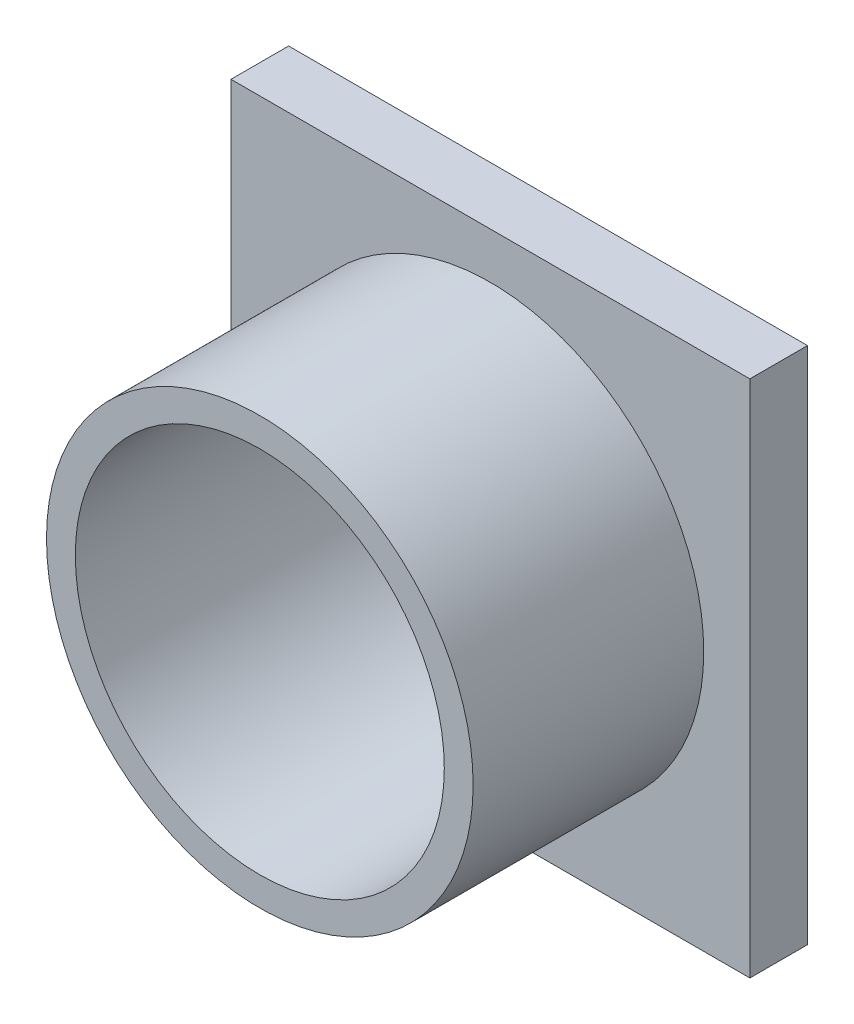
ISO-10303-21;
HEADER;
FILE_DESCRIPTION(('STEP AP214'),'2;1');
FILE_NAME('part.step','',(''),(''),'','','');
FILE_SCHEMA(('AUTOMOTIVE_DESIGN { 1 0 10303 214 1 1 1 1 }'));
ENDSEC;
DATA;
#1=APPLICATION_CONTEXT('core data for automotive mechanical design processes');
#2=APPLICATION_PROTOCOL_DEFINITION('international standard','automotive_design',2000,#1);
#3=PRODUCT_CONTEXT('',#1,'mechanical');
#4=PRODUCT('Part','Part','',(#3));
#5=PRODUCT_RELATED_PRODUCT_CATEGORY('part','',(#4));
#6=PRODUCT_DEFINITION_FORMATION('','',#4);
#7=PRODUCT_DEFINITION_CONTEXT('part definition',#1,'design');
#8=PRODUCT_DEFINITION('design','',#6,#7);
#9=PRODUCT_DEFINITION_SHAPE('','',#8);
#10=(LENGTH_UNIT() NAMED_UNIT(*) SI_UNIT(.MILLI.,.METRE.));
#11=(NAMED_UNIT(*) PLANE_ANGLE_UNIT() SI_UNIT($,.RADIAN.));
#12=(NAMED_UNIT(*) SI_UNIT($,.STERADIAN.) SOLID_ANGLE_UNIT());
#13=UNCERTAINTY_MEASURE_WITH_UNIT(LENGTH_MEASURE(1.E-05),#10,'distance_accuracy_value','');
#14=(GEOMETRIC_REPRESENTATION_CONTEXT(3) GLOBAL_UNCERTAINTY_ASSIGNED_CONTEXT((#13)) GLOBAL_UNIT_ASSIGNED_CONTEXT((#10,
#11,#12)) REPRESENTATION_CONTEXT('',''));
#15=CARTESIAN_POINT('',(0.,0.,0.));
#16=DIRECTION('',(0.,0.,1.));
#17=DIRECTION('',(1.,0.,0.));
#18=AXIS2_PLACEMENT_3D('',#15,#16,#17);
#19=CARTESIAN_POINT('',(0.,0.,0.));
#20=DIRECTION('',(0.,0.,1.));
#21=DIRECTION('',(1.,0.,0.));
#22=AXIS2_PLACEMENT_3D('',#19,#20,#21);
#23=PLANE('',#22);
#24=DIRECTION('',(-1.,0.,0.));
#25=VECTOR('',#24,1.);
#26=CARTESIAN_POINT('',(19.,-19.,0.));
#27=LINE('',#26,#25);
#28=CARTESIAN_POINT('',(19.,-19.,0.));
#29=VERTEX_POINT('',#28);
#30=CARTESIAN_POINT('',(14.,-19.,0.));
#31=VERTEX_POINT('',#30);
#32=EDGE_CURVE('E228',#29,#31,#27,.T.);
#33=ORIENTED_EDGE('',*,*,#32,.F.);
#34=DIRECTION('',(0.,-1.,0.));
#35=VECTOR('',#34,1.);
#36=CARTESIAN_POINT('',(19.,-19.,0.));
#37=LINE('',#36,#35);
#38=CARTESIAN_POINT('',(19.,-15.,0.));
#39=VERTEX_POINT('',#38);
#40=EDGE_CURVE('E218',#39,#29,#37,.T.);
#41=ORIENTED_EDGE('',*,*,#40,.F.);
#42=DIRECTION('',(1.,0.,0.));
#43=VECTOR('',#42,1.);
#44=CARTESIAN_POINT('',(19.,-15.,0.));
#45=LINE('',#44,#43);
#46=CARTESIAN_POINT('',(14.,-15.,0.));
#47=VERTEX_POINT('',#46);
#48=EDGE_CURVE('E221',#47,#39,#45,.T.);
#49=ORIENTED_EDGE('',*,*,#48,.F.);
#50=DIRECTION('',(0.,1.,0.));
#51=VECTOR('',#50,1.);
#52=CARTESIAN_POINT('',(14.,-19.,0.));
#53=LINE('',#52,#51);
#54=EDGE_CURVE('E225',#31,#47,#53,.T.);
#55=ORIENTED_EDGE('',*,*,#54,.F.);
#56=EDGE_LOOP('',(#33,#41,#49,#55));
#57=FACE_BOUND('',#56,.T.);
#58=DIRECTION('',(0.,1.,0.));
#59=VECTOR('',#58,1.);
#60=CARTESIAN_POINT('',(14.,19.,0.));
#61=LINE('',#60,#59);
#62=CARTESIAN_POINT('',(14.,15.,0.));
#63=VERTEX_POINT('',#62);
#64=CARTESIAN_POINT('',(14.,19.,0.));
#65=VERTEX_POINT('',#64);
#66=EDGE_CURVE('E264',#63,#65,#61,.T.);
#67=ORIENTED_EDGE('',*,*,#66,.F.);
#68=DIRECTION('',(-1.,0.,0.));
#69=VECTOR('',#68,1.);
#70=CARTESIAN_POINT('',(19.,15.,0.));
#71=LINE('',#70,#69);
#72=CARTESIAN_POINT('',(19.,15.,0.));
#73=VERTEX_POINT('',#72);
#74=EDGE_CURVE('E276',#73,#63,#71,.T.);
#75=ORIENTED_EDGE('',*,*,#74,.F.);
#76=DIRECTION('',(0.,-1.,0.));
#77=VECTOR('',#76,1.);
#78=CARTESIAN_POINT('',(19.,19.,0.));
#79=LINE('',#78,#77);
#80=CARTESIAN_POINT('',(19.,19.,0.));
#81=VERTEX_POINT('',#80);
#82=EDGE_CURVE('E288',#81,#73,#79,.T.);
#83=ORIENTED_EDGE('',*,*,#82,.F.);
#84=DIRECTION('',(1.,0.,0.));
#85=VECTOR('',#84,1.);
#86=CARTESIAN_POINT('',(19.,19.,0.));
#87=LINE('',#86,#85);
#88=EDGE_CURVE('E285',#65,#81,#87,.T.);
#89=ORIENTED_EDGE('',*,*,#88,.F.);
#90=EDGE_LOOP('',(#67,#75,#83,#89));
#91=FACE_BOUND('',#90,.T.);
#92=DIRECTION('',(0.,1.,0.));
#93=VECTOR('',#92,1.);
#94=CARTESIAN_POINT('',(22.5,22.5,0.));
#95=LINE('',#94,#93);
#96=CARTESIAN_POINT('',(22.5,-22.5,0.));
#97=VERTEX_POINT('',#96);
#98=CARTESIAN_POINT('',(22.5,22.5,0.));
#99=VERTEX_POINT('',#98);
#100=EDGE_CURVE('E316',#97,#99,#95,.T.);
#101=ORIENTED_EDGE('',*,*,#100,.F.);
#102=DIRECTION('',(1.,0.,0.));
#103=VECTOR('',#102,1.);
#104=CARTESIAN_POINT('',(-22.5,-22.5,0.));
#105=LINE('',#104,#103);
#106=CARTESIAN_POINT('',(-22.5,-22.5,0.));
#107=VERTEX_POINT('',#106);
#108=EDGE_CURVE('E321',#107,#97,#105,.T.);
#109=ORIENTED_EDGE('',*,*,#108,.F.);
#110=DIRECTION('',(0.,-1.,0.));
#111=VECTOR('',#110,1.);
#112=CARTESIAN_POINT('',(-22.5,22.5,0.));
#113=LINE('',#112,#111);
#114=CARTESIAN_POINT('',(-22.5,22.5,0.));
#115=VERTEX_POINT('',#114);
#116=EDGE_CURVE('E332',#115,#107,#113,.T.);
#117=ORIENTED_EDGE('',*,*,#116,.F.);
#118=DIRECTION('',(-1.,0.,0.));
#119=VECTOR('',#118,1.);
#120=CARTESIAN_POINT('',(-22.5,22.5,0.));
#121=LINE('',#120,#119);
#122=EDGE_CURVE('E330',#99,#115,#121,.T.);
#123=ORIENTED_EDGE('',*,*,#122,.F.);
#124=EDGE_LOOP('',(#101,#109,#117,#123));
#125=FACE_BOUND('',#124,.T.);
#126=CARTESIAN_POINT('',(0.,0.,0.));
#127=DIRECTION('',(0.,0.,1.));
#128=DIRECTION('',(1.,0.,0.));
#129=AXIS2_PLACEMENT_3D('',#126,#127,#128);
#130=CIRCLE('',#129,16.);
#131=CARTESIAN_POINT('',(16.,0.,0.));
#132=VERTEX_POINT('',#131);
#133=EDGE_CURVE('E311',#132,#132,#130,.T.);
#134=ORIENTED_EDGE('',*,*,#133,.T.);
#135=EDGE_LOOP('',(#134));
#136=FACE_BOUND('',#135,.T.);
#137=DIRECTION('',(1.,0.,0.));
#138=VECTOR('',#137,1.);
#139=CARTESIAN_POINT('',(-19.,19.,0.));
#140=LINE('',#139,#138);
#141=CARTESIAN_POINT('',(-19.,19.,0.));
#142=VERTEX_POINT('',#141);
#143=CARTESIAN_POINT('',(-14.,19.,0.));
#144=VERTEX_POINT('',#143);
#145=EDGE_CURVE('E261',#142,#144,#140,.T.);
#146=ORIENTED_EDGE('',*,*,#145,.F.);
#147=DIRECTION('',(0.,1.,0.));
#148=VECTOR('',#147,1.);
#149=CARTESIAN_POINT('',(-19.,19.,0.));
#150=LINE('',#149,#148);
#151=CARTESIAN_POINT('',(-19.,15.,0.));
#152=VERTEX_POINT('',#151);
#153=EDGE_CURVE('E251',#152,#142,#150,.T.);
#154=ORIENTED_EDGE('',*,*,#153,.F.);
#155=DIRECTION('',(-1.,0.,0.));
#156=VECTOR('',#155,1.);
#157=CARTESIAN_POINT('',(-19.,15.,0.));
#158=LINE('',#157,#156);
#159=CARTESIAN_POINT('',(-14.,15.,0.));
#160=VERTEX_POINT('',#159);
#161=EDGE_CURVE('E254',#160,#152,#158,.T.);
#162=ORIENTED_EDGE('',*,*,#161,.F.);
#163=DIRECTION('',(0.,-1.,0.));
#164=VECTOR('',#163,1.);
#165=CARTESIAN_POINT('',(-14.,19.,0.));
#166=LINE('',#165,#164);
#167=EDGE_CURVE('E258',#144,#160,#166,.T.);
#168=ORIENTED_EDGE('',*,*,#167,.F.);
#169=EDGE_LOOP('',(#146,#154,#162,#168));
#170=FACE_BOUND('',#169,.T.);
#171=DIRECTION('',(0.,1.,0.));
#172=VECTOR('',#171,1.);
#173=CARTESIAN_POINT('',(-19.,-19.,0.));
#174=LINE('',#173,#172);
#175=CARTESIAN_POINT('',(-19.,-19.,0.));
#176=VERTEX_POINT('',#175);
#177=CARTESIAN_POINT('',(-19.,-15.,0.));
#178=VERTEX_POINT('',#177);
#179=EDGE_CURVE('E171',#176,#178,#174,.T.);
#180=ORIENTED_EDGE('',*,*,#179,.F.);
#181=DIRECTION('',(-1.,0.,0.));
#182=VECTOR('',#181,1.);
#183=CARTESIAN_POINT('',(-19.,-19.,0.));
#184=LINE('',#183,#182);
#185=CARTESIAN_POINT('',(-14.,-19.,0.));
#186=VERTEX_POINT('',#185);
#187=EDGE_CURVE('E173',#186,#176,#184,.T.);
#188=ORIENTED_EDGE('',*,*,#187,.F.);
#189=DIRECTION('',(0.,-1.,0.));
#190=VECTOR('',#189,1.);
#191=CARTESIAN_POINT('',(-14.,-19.,0.));
#192=LINE('',#191,#190);
#193=CARTESIAN_POINT('',(-14.,-15.,0.));
#194=VERTEX_POINT('',#193);
#195=EDGE_CURVE('E58',#194,#186,#192,.T.);
#196=ORIENTED_EDGE('',*,*,#195,.F.);
#197=DIRECTION('',(1.,0.,0.));
#198=VECTOR('',#197,1.);
#199=CARTESIAN_POINT('',(-19.,-15.,0.));
#200=LINE('',#199,#198);
#201=EDGE_CURVE('E53',#178,#194,#200,.T.);
#202=ORIENTED_EDGE('',*,*,#201,.F.);
#203=EDGE_LOOP('',(#180,#188,#196,#202));
#204=FACE_BOUND('',#203,.T.);
#205=ADVANCED_FACE('F38',(#57,#91,#125,#136,#170,#204),#23,.F.);
#206=CARTESIAN_POINT('',(0.,0.,5.));
#207=DIRECTION('',(0.,0.,1.));
#208=DIRECTION('',(1.,0.,0.));
#209=AXIS2_PLACEMENT_3D('',#206,#207,#208);
#210=PLANE('',#209);
#211=DIRECTION('',(0.,1.,0.));
#212=VECTOR('',#211,1.);
#213=CARTESIAN_POINT('',(22.5,22.5,5.));
#214=LINE('',#213,#212);
#215=CARTESIAN_POINT('',(22.5,-22.5,5.));
#216=VERTEX_POINT('',#215);
#217=CARTESIAN_POINT('',(22.5,22.5,5.));
#218=VERTEX_POINT('',#217);
#219=EDGE_CURVE('E317',#216,#218,#214,.T.);
#220=ORIENTED_EDGE('',*,*,#219,.T.);
#221=DIRECTION('',(-1.,0.,0.));
#222=VECTOR('',#221,1.);
#223=CARTESIAN_POINT('',(-22.5,22.5,5.));
#224=LINE('',#223,#222);
#225=CARTESIAN_POINT('',(-22.5,22.5,5.));
#226=VERTEX_POINT('',#225);
#227=EDGE_CURVE('E320',#218,#226,#224,.T.);
#228=ORIENTED_EDGE('',*,*,#227,.T.);
#229=DIRECTION('',(0.,-1.,0.));
#230=VECTOR('',#229,1.);
#231=CARTESIAN_POINT('',(-22.5,22.5,5.));
#232=LINE('',#231,#230);
#233=CARTESIAN_POINT('',(-22.5,-22.5,5.));
#234=VERTEX_POINT('',#233);
#235=EDGE_CURVE('E323',#226,#234,#232,.T.);
#236=ORIENTED_EDGE('',*,*,#235,.T.);
#237=DIRECTION('',(1.,0.,0.));
#238=VECTOR('',#237,1.);
#239=CARTESIAN_POINT('',(-22.5,-22.5,5.));
#240=LINE('',#239,#238);
#241=EDGE_CURVE('E325',#234,#216,#240,.T.);
#242=ORIENTED_EDGE('',*,*,#241,.T.);
#243=EDGE_LOOP('',(#220,#228,#236,#242));
#244=FACE_BOUND('',#243,.T.);
#245=CARTESIAN_POINT('',(0.,0.,5.));
#246=DIRECTION('',(0.,0.,1.));
#247=DIRECTION('',(1.,0.,0.));
#248=AXIS2_PLACEMENT_3D('',#245,#246,#247);
#249=CIRCLE('',#248,18.5);
#250=CARTESIAN_POINT('',(18.5,0.,5.));
#251=VERTEX_POINT('',#250);
#252=EDGE_CURVE('E307',#251,#251,#249,.T.);
#253=ORIENTED_EDGE('',*,*,#252,.F.);
#254=EDGE_LOOP('',(#253));
#255=FACE_BOUND('',#254,.T.);
#256=ADVANCED_FACE('F359',(#244,#255),#210,.T.);
#257=CARTESIAN_POINT('',(22.5,22.5,5.));
#258=DIRECTION('',(-1.,0.,0.));
#259=DIRECTION('',(0.,-1.,0.));
#260=AXIS2_PLACEMENT_3D('',#257,#258,#259);
#261=PLANE('',#260);
#262=ORIENTED_EDGE('',*,*,#100,.T.);
#263=DIRECTION('',(0.,0.,-1.));
#264=VECTOR('',#263,1.);
#265=CARTESIAN_POINT('',(22.5,22.5,5.));
#266=LINE('',#265,#264);
#267=EDGE_CURVE('E11',#218,#99,#266,.T.);
#268=ORIENTED_EDGE('',*,*,#267,.F.);
#269=ORIENTED_EDGE('',*,*,#219,.F.);
#270=DIRECTION('',(0.,0.,-1.));
#271=VECTOR('',#270,1.);
#272=CARTESIAN_POINT('',(22.5,-22.5,5.));
#273=LINE('',#272,#271);
#274=EDGE_CURVE('E327',#216,#97,#273,.T.);
#275=ORIENTED_EDGE('',*,*,#274,.T.);
#276=EDGE_LOOP('',(#262,#268,#269,#275));
#277=FACE_BOUND('',#276,.T.);
#278=ADVANCED_FACE('F40',(#277),#261,.F.);
#279=CARTESIAN_POINT('',(-22.5,22.5,5.));
#280=DIRECTION('',(0.,-1.,0.));
#281=DIRECTION('',(0.,0.,-1.));
#282=AXIS2_PLACEMENT_3D('',#279,#280,#281);
#283=PLANE('',#282);
#284=ORIENTED_EDGE('',*,*,#122,.T.);
#285=DIRECTION('',(0.,0.,-1.));
#286=VECTOR('',#285,1.);
#287=CARTESIAN_POINT('',(-22.5,22.5,5.));
#288=LINE('',#287,#286);
#289=EDGE_CURVE('E46',#226,#115,#288,.T.);
#290=ORIENTED_EDGE('',*,*,#289,.F.);
#291=ORIENTED_EDGE('',*,*,#227,.F.);
#292=ORIENTED_EDGE('',*,*,#267,.T.);
#293=EDGE_LOOP('',(#284,#290,#291,#292));
#294=FACE_BOUND('',#293,.T.);
#295=ADVANCED_FACE('F361',(#294),#283,.F.);
#296=CARTESIAN_POINT('',(-22.5,22.5,5.));
#297=DIRECTION('',(1.,0.,0.));
#298=DIRECTION('',(0.,1.,0.));
#299=AXIS2_PLACEMENT_3D('',#296,#297,#298);
#300=PLANE('',#299);
#301=ORIENTED_EDGE('',*,*,#116,.T.);
#302=DIRECTION('',(0.,0.,-1.));
#303=VECTOR('',#302,1.);
#304=CARTESIAN_POINT('',(-22.5,-22.5,5.));
#305=LINE('',#304,#303);
#306=EDGE_CURVE('E337',#234,#107,#305,.T.);
#307=ORIENTED_EDGE('',*,*,#306,.F.);
#308=ORIENTED_EDGE('',*,*,#235,.F.);
#309=ORIENTED_EDGE('',*,*,#289,.T.);
#310=EDGE_LOOP('',(#301,#307,#308,#309));
#311=FACE_BOUND('',#310,.T.);
#312=ADVANCED_FACE('F344',(#311),#300,.F.);
#313=CARTESIAN_POINT('',(-22.5,-22.5,5.));
#314=DIRECTION('',(0.,1.,0.));
#315=DIRECTION('',(0.,0.,1.));
#316=AXIS2_PLACEMENT_3D('',#313,#314,#315);
#317=PLANE('',#316);
#318=ORIENTED_EDGE('',*,*,#108,.T.);
#319=ORIENTED_EDGE('',*,*,#274,.F.);
#320=ORIENTED_EDGE('',*,*,#241,.F.);
#321=ORIENTED_EDGE('',*,*,#306,.T.);
#322=EDGE_LOOP('',(#318,#319,#320,#321));
#323=FACE_BOUND('',#322,.T.);
#324=ADVANCED_FACE('F353',(#323),#317,.F.);
#325=CARTESIAN_POINT('',(0.,0.,5.));
#326=DIRECTION('',(0.,0.,-1.));
#327=DIRECTION('',(-1.,0.,0.));
#328=AXIS2_PLACEMENT_3D('',#325,#326,#327);
#329=CYLINDRICAL_SURFACE('',#328,16.);
#330=ORIENTED_EDGE('',*,*,#133,.F.);
#331=EDGE_LOOP('',(#330));
#332=FACE_BOUND('',#331,.T.);
#333=CARTESIAN_POINT('',(0.,0.,25.));
#334=DIRECTION('',(0.,0.,1.));
#335=DIRECTION('',(1.,0.,0.));
#336=AXIS2_PLACEMENT_3D('',#333,#334,#335);
#337=CIRCLE('',#336,16.);
#338=CARTESIAN_POINT('',(16.,0.,25.));
#339=VERTEX_POINT('',#338);
#340=EDGE_CURVE('E304',#339,#339,#337,.T.);
#341=ORIENTED_EDGE('',*,*,#340,.T.);
#342=EDGE_LOOP('',(#341));
#343=FACE_BOUND('',#342,.T.);
#344=ADVANCED_FACE('F379',(#332,#343),#329,.F.);
#345=CARTESIAN_POINT('',(0.,0.,25.));
#346=DIRECTION('',(0.,0.,1.));
#347=DIRECTION('',(1.,0.,0.));
#348=AXIS2_PLACEMENT_3D('',#345,#346,#347);
#349=PLANE('',#348);
#350=CARTESIAN_POINT('',(0.,0.,25.));
#351=DIRECTION('',(0.,0.,1.));
#352=DIRECTION('',(1.,0.,0.));
#353=AXIS2_PLACEMENT_3D('',#350,#351,#352);
#354=CIRCLE('',#353,18.5);
#355=CARTESIAN_POINT('',(18.5,0.,25.));
#356=VERTEX_POINT('',#355);
#357=EDGE_CURVE('E308',#356,#356,#354,.T.);
#358=ORIENTED_EDGE('',*,*,#357,.T.);
#359=EDGE_LOOP('',(#358));
#360=FACE_BOUND('',#359,.T.);
#361=ORIENTED_EDGE('',*,*,#340,.F.);
#362=EDGE_LOOP('',(#361));
#363=FACE_BOUND('',#362,.T.);
#364=ADVANCED_FACE('F383',(#360,#363),#349,.T.);
#365=CARTESIAN_POINT('',(0.,0.,25.));
#366=DIRECTION('',(0.,0.,-1.));
#367=DIRECTION('',(-1.,0.,0.));
#368=AXIS2_PLACEMENT_3D('',#365,#366,#367);
#369=CYLINDRICAL_SURFACE('',#368,18.5);
#370=ORIENTED_EDGE('',*,*,#357,.F.);
#371=EDGE_LOOP('',(#370));
#372=FACE_BOUND('',#371,.T.);
#373=ORIENTED_EDGE('',*,*,#252,.T.);
#374=EDGE_LOOP('',(#373));
#375=FACE_BOUND('',#374,.T.);
#376=ADVANCED_FACE('F388',(#372,#375),#369,.T.);
#377=CARTESIAN_POINT('',(14.,19.,-3.));
#378=DIRECTION('',(1.,0.,0.));
#379=DIRECTION('',(0.,0.,-1.));
#380=AXIS2_PLACEMENT_3D('',#377,#378,#379);
#381=PLANE('',#380);
#382=ORIENTED_EDGE('',*,*,#66,.T.);
#383=DIRECTION('',(0.,0.,1.));
#384=VECTOR('',#383,1.);
#385=CARTESIAN_POINT('',(14.,19.,-3.));
#386=LINE('',#385,#384);
#387=CARTESIAN_POINT('',(14.,19.,-3.));
#388=VERTEX_POINT('',#387);
#389=EDGE_CURVE('E301',#388,#65,#386,.T.);
#390=ORIENTED_EDGE('',*,*,#389,.F.);
#391=DIRECTION('',(0.,1.,0.));
#392=VECTOR('',#391,1.);
#393=CARTESIAN_POINT('',(14.,19.,-3.));
#394=LINE('',#393,#392);
#395=CARTESIAN_POINT('',(14.,15.,-3.));
#396=VERTEX_POINT('',#395);
#397=EDGE_CURVE('E272',#396,#388,#394,.T.);
#398=ORIENTED_EDGE('',*,*,#397,.F.);
#399=DIRECTION('',(0.,0.,1.));
#400=VECTOR('',#399,1.);
#401=CARTESIAN_POINT('',(14.,15.,-3.));
#402=LINE('',#401,#400);
#403=EDGE_CURVE('E282',#396,#63,#402,.T.);
#404=ORIENTED_EDGE('',*,*,#403,.T.);
#405=EDGE_LOOP('',(#382,#390,#398,#404));
#406=FACE_BOUND('',#405,.T.);
#407=ADVANCED_FACE('F395',(#406),#381,.F.);
#408=CARTESIAN_POINT('',(19.,19.,-3.));
#409=DIRECTION('',(0.,-1.,0.));
#410=DIRECTION('',(0.,0.,-1.));
#411=AXIS2_PLACEMENT_3D('',#408,#409,#410);
#412=PLANE('',#411);
#413=ORIENTED_EDGE('',*,*,#88,.T.);
#414=DIRECTION('',(0.,0.,1.));
#415=VECTOR('',#414,1.);
#416=CARTESIAN_POINT('',(19.,19.,-3.));
#417=LINE('',#416,#415);
#418=CARTESIAN_POINT('',(19.,19.,-3.));
#419=VERTEX_POINT('',#418);
#420=EDGE_CURVE('E298',#419,#81,#417,.T.);
#421=ORIENTED_EDGE('',*,*,#420,.F.);
#422=DIRECTION('',(1.,0.,0.));
#423=VECTOR('',#422,1.);
#424=CARTESIAN_POINT('',(19.,19.,-3.));
#425=LINE('',#424,#423);
#426=EDGE_CURVE('E275',#388,#419,#425,.T.);
#427=ORIENTED_EDGE('',*,*,#426,.F.);
#428=ORIENTED_EDGE('',*,*,#389,.T.);
#429=EDGE_LOOP('',(#413,#421,#427,#428));
#430=FACE_BOUND('',#429,.T.);
#431=ADVANCED_FACE('F400',(#430),#412,.F.);
#432=CARTESIAN_POINT('',(19.,19.,-3.));
#433=DIRECTION('',(-1.,0.,0.));
#434=DIRECTION('',(0.,0.,1.));
#435=AXIS2_PLACEMENT_3D('',#432,#433,#434);
#436=PLANE('',#435);
#437=ORIENTED_EDGE('',*,*,#82,.T.);
#438=DIRECTION('',(0.,0.,1.));
#439=VECTOR('',#438,1.);
#440=CARTESIAN_POINT('',(19.,15.,-3.));
#441=LINE('',#440,#439);
#442=CARTESIAN_POINT('',(19.,15.,-3.));
#443=VERTEX_POINT('',#442);
#444=EDGE_CURVE('E295',#443,#73,#441,.T.);
#445=ORIENTED_EDGE('',*,*,#444,.F.);
#446=DIRECTION('',(0.,-1.,0.));
#447=VECTOR('',#446,1.);
#448=CARTESIAN_POINT('',(19.,19.,-3.));
#449=LINE('',#448,#447);
#450=EDGE_CURVE('E278',#419,#443,#449,.T.);
#451=ORIENTED_EDGE('',*,*,#450,.F.);
#452=ORIENTED_EDGE('',*,*,#420,.T.);
#453=EDGE_LOOP('',(#437,#445,#451,#452));
#454=FACE_BOUND('',#453,.T.);
#455=ADVANCED_FACE('F404',(#454),#436,.F.);
#456=CARTESIAN_POINT('',(19.,15.,-3.));
#457=DIRECTION('',(0.,1.,0.));
#458=DIRECTION('',(0.,0.,1.));
#459=AXIS2_PLACEMENT_3D('',#456,#457,#458);
#460=PLANE('',#459);
#461=ORIENTED_EDGE('',*,*,#74,.T.);
#462=ORIENTED_EDGE('',*,*,#403,.F.);
#463=DIRECTION('',(-1.,0.,0.));
#464=VECTOR('',#463,1.);
#465=CARTESIAN_POINT('',(19.,15.,-3.));
#466=LINE('',#465,#464);
#467=EDGE_CURVE('E280',#443,#396,#466,.T.);
#468=ORIENTED_EDGE('',*,*,#467,.F.);
#469=ORIENTED_EDGE('',*,*,#444,.T.);
#470=EDGE_LOOP('',(#461,#462,#468,#469));
#471=FACE_BOUND('',#470,.T.);
#472=ADVANCED_FACE('F408',(#471),#460,.F.);
#473=CARTESIAN_POINT('',(0.,0.,-3.));
#474=DIRECTION('',(0.,0.,-1.));
#475=DIRECTION('',(-1.,0.,0.));
#476=AXIS2_PLACEMENT_3D('',#473,#474,#475);
#477=PLANE('',#476);
#478=ORIENTED_EDGE('',*,*,#397,.T.);
#479=ORIENTED_EDGE('',*,*,#426,.T.);
#480=ORIENTED_EDGE('',*,*,#450,.T.);
#481=ORIENTED_EDGE('',*,*,#467,.T.);
#482=EDGE_LOOP('',(#478,#479,#480,#481));
#483=FACE_BOUND('',#482,.T.);
#484=ADVANCED_FACE('F412',(#483),#477,.T.);
#485=CARTESIAN_POINT('',(-19.,19.,-3.));
#486=DIRECTION('',(0.,-1.,0.));
#487=DIRECTION('',(0.,0.,-1.));
#488=AXIS2_PLACEMENT_3D('',#485,#486,#487);
#489=PLANE('',#488);
#490=ORIENTED_EDGE('',*,*,#145,.T.);
#491=DIRECTION('',(0.,0.,1.));
#492=VECTOR('',#491,1.);
#493=CARTESIAN_POINT('',(-14.,19.,-3.));
#494=LINE('',#493,#492);
#495=CARTESIAN_POINT('',(-14.,19.,-3.));
#496=VERTEX_POINT('',#495);
#497=EDGE_CURVE('E231',#496,#144,#494,.T.);
#498=ORIENTED_EDGE('',*,*,#497,.F.);
#499=DIRECTION('',(1.,0.,0.));
#500=VECTOR('',#499,1.);
#501=CARTESIAN_POINT('',(-19.,19.,-3.));
#502=LINE('',#501,#500);
#503=CARTESIAN_POINT('',(-19.,19.,-3.));
#504=VERTEX_POINT('',#503);
#505=EDGE_CURVE('E255',#504,#496,#502,.T.);
#506=ORIENTED_EDGE('',*,*,#505,.F.);
#507=DIRECTION('',(0.,0.,1.));
#508=VECTOR('',#507,1.);
#509=CARTESIAN_POINT('',(-19.,19.,-3.));
#510=LINE('',#509,#508);
#511=EDGE_CURVE('E247',#504,#142,#510,.T.);
#512=ORIENTED_EDGE('',*,*,#511,.T.);
#513=EDGE_LOOP('',(#490,#498,#506,#512));
#514=FACE_BOUND('',#513,.T.);
#515=ADVANCED_FACE('F416',(#514),#489,.F.);
#516=CARTESIAN_POINT('',(-14.,19.,-3.));
#517=DIRECTION('',(-1.,0.,0.));
#518=DIRECTION('',(0.,-1.,0.));
#519=AXIS2_PLACEMENT_3D('',#516,#517,#518);
#520=PLANE('',#519);
#521=ORIENTED_EDGE('',*,*,#167,.T.);
#522=DIRECTION('',(0.,0.,1.));
#523=VECTOR('',#522,1.);
#524=CARTESIAN_POINT('',(-14.,15.,-3.));
#525=LINE('',#524,#523);
#526=CARTESIAN_POINT('',(-14.,15.,-3.));
#527=VERTEX_POINT('',#526);
#528=EDGE_CURVE('E241',#527,#160,#525,.T.);
#529=ORIENTED_EDGE('',*,*,#528,.F.);
#530=DIRECTION('',(0.,-1.,0.));
#531=VECTOR('',#530,1.);
#532=CARTESIAN_POINT('',(-14.,19.,-3.));
#533=LINE('',#532,#531);
#534=EDGE_CURVE('E268',#496,#527,#533,.T.);
#535=ORIENTED_EDGE('',*,*,#534,.F.);
#536=ORIENTED_EDGE('',*,*,#497,.T.);
#537=EDGE_LOOP('',(#521,#529,#535,#536));
#538=FACE_BOUND('',#537,.T.);
#539=ADVANCED_FACE('F430',(#538),#520,.F.);
#540=CARTESIAN_POINT('',(-19.,15.,-3.));
#541=DIRECTION('',(0.,1.,0.));
#542=DIRECTION('',(-1.,0.,0.));
#543=AXIS2_PLACEMENT_3D('',#540,#541,#542);
#544=PLANE('',#543);
#545=ORIENTED_EDGE('',*,*,#161,.T.);
#546=DIRECTION('',(0.,0.,1.));
#547=VECTOR('',#546,1.);
#548=CARTESIAN_POINT('',(-19.,15.,-3.));
#549=LINE('',#548,#547);
#550=CARTESIAN_POINT('',(-19.,15.,-3.));
#551=VERTEX_POINT('',#550);
#552=EDGE_CURVE('E244',#551,#152,#549,.T.);
#553=ORIENTED_EDGE('',*,*,#552,.F.);
#554=DIRECTION('',(-1.,0.,0.));
#555=VECTOR('',#554,1.);
#556=CARTESIAN_POINT('',(-19.,15.,-3.));
#557=LINE('',#556,#555);
#558=EDGE_CURVE('E266',#527,#551,#557,.T.);
#559=ORIENTED_EDGE('',*,*,#558,.F.);
#560=ORIENTED_EDGE('',*,*,#528,.T.);
#561=EDGE_LOOP('',(#545,#553,#559,#560));
#562=FACE_BOUND('',#561,.T.);
#563=ADVANCED_FACE('F426',(#562),#544,.F.);
#564=CARTESIAN_POINT('',(-19.,19.,-3.));
#565=DIRECTION('',(1.,0.,0.));
#566=DIRECTION('',(0.,0.,-1.));
#567=AXIS2_PLACEMENT_3D('',#564,#565,#566);
#568=PLANE('',#567);
#569=ORIENTED_EDGE('',*,*,#153,.T.);
#570=ORIENTED_EDGE('',*,*,#511,.F.);
#571=DIRECTION('',(0.,1.,0.));
#572=VECTOR('',#571,1.);
#573=CARTESIAN_POINT('',(-19.,19.,-3.));
#574=LINE('',#573,#572);
#575=EDGE_CURVE('E250',#551,#504,#574,.T.);
#576=ORIENTED_EDGE('',*,*,#575,.F.);
#577=ORIENTED_EDGE('',*,*,#552,.T.);
#578=EDGE_LOOP('',(#569,#570,#576,#577));
#579=FACE_BOUND('',#578,.T.);
#580=ADVANCED_FACE('F422',(#579),#568,.F.);
#581=CARTESIAN_POINT('',(0.,0.,-3.));
#582=DIRECTION('',(0.,0.,-1.));
#583=DIRECTION('',(-1.,0.,0.));
#584=AXIS2_PLACEMENT_3D('',#581,#582,#583);
#585=PLANE('',#584);
#586=ORIENTED_EDGE('',*,*,#505,.T.);
#587=ORIENTED_EDGE('',*,*,#534,.T.);
#588=ORIENTED_EDGE('',*,*,#558,.T.);
#589=ORIENTED_EDGE('',*,*,#575,.T.);
#590=EDGE_LOOP('',(#586,#587,#588,#589));
#591=FACE_BOUND('',#590,.T.);
#592=ADVANCED_FACE('F418',(#591),#585,.T.);
#593=CARTESIAN_POINT('',(19.,-19.,-3.));
#594=DIRECTION('',(0.,1.,0.));
#595=DIRECTION('',(-1.,0.,0.));
#596=AXIS2_PLACEMENT_3D('',#593,#594,#595);
#597=PLANE('',#596);
#598=ORIENTED_EDGE('',*,*,#32,.T.);
#599=DIRECTION('',(0.,0.,1.));
#600=VECTOR('',#599,1.);
#601=CARTESIAN_POINT('',(14.,-19.,-3.));
#602=LINE('',#601,#600);
#603=CARTESIAN_POINT('',(14.,-19.,-3.));
#604=VERTEX_POINT('',#603);
#605=EDGE_CURVE('E177',#604,#31,#602,.T.);
#606=ORIENTED_EDGE('',*,*,#605,.F.);
#607=DIRECTION('',(-1.,0.,0.));
#608=VECTOR('',#607,1.);
#609=CARTESIAN_POINT('',(19.,-19.,-3.));
#610=LINE('',#609,#608);
#611=CARTESIAN_POINT('',(19.,-19.,-3.));
#612=VERTEX_POINT('',#611);
#613=EDGE_CURVE('E222',#612,#604,#610,.T.);
#614=ORIENTED_EDGE('',*,*,#613,.F.);
#615=DIRECTION('',(0.,0.,1.));
#616=VECTOR('',#615,1.);
#617=CARTESIAN_POINT('',(19.,-19.,-3.));
#618=LINE('',#617,#616);
#619=EDGE_CURVE('E214',#612,#29,#618,.T.);
#620=ORIENTED_EDGE('',*,*,#619,.T.);
#621=EDGE_LOOP('',(#598,#606,#614,#620));
#622=FACE_BOUND('',#621,.T.);
#623=ADVANCED_FACE('F421',(#622),#597,.F.);
#624=CARTESIAN_POINT('',(14.,-19.,-3.));
#625=DIRECTION('',(1.,0.,0.));
#626=DIRECTION('',(0.,0.,-1.));
#627=AXIS2_PLACEMENT_3D('',#624,#625,#626);
#628=PLANE('',#627);
#629=ORIENTED_EDGE('',*,*,#54,.T.);
#630=DIRECTION('',(0.,0.,1.));
#631=VECTOR('',#630,1.);
#632=CARTESIAN_POINT('',(14.,-15.,-3.));
#633=LINE('',#632,#631);
#634=CARTESIAN_POINT('',(14.,-15.,-3.));
#635=VERTEX_POINT('',#634);
#636=EDGE_CURVE('E208',#635,#47,#633,.T.);
#637=ORIENTED_EDGE('',*,*,#636,.F.);
#638=DIRECTION('',(0.,1.,0.));
#639=VECTOR('',#638,1.);
#640=CARTESIAN_POINT('',(14.,-19.,-3.));
#641=LINE('',#640,#639);
#642=EDGE_CURVE('E235',#604,#635,#641,.T.);
#643=ORIENTED_EDGE('',*,*,#642,.F.);
#644=ORIENTED_EDGE('',*,*,#605,.T.);
#645=EDGE_LOOP('',(#629,#637,#643,#644));
#646=FACE_BOUND('',#645,.T.);
#647=ADVANCED_FACE('F449',(#646),#628,.F.);
#648=CARTESIAN_POINT('',(19.,-15.,-3.));
#649=DIRECTION('',(0.,-1.,0.));
#650=DIRECTION('',(1.,0.,0.));
#651=AXIS2_PLACEMENT_3D('',#648,#649,#650);
#652=PLANE('',#651);
#653=ORIENTED_EDGE('',*,*,#48,.T.);
#654=DIRECTION('',(0.,0.,1.));
#655=VECTOR('',#654,1.);
#656=CARTESIAN_POINT('',(19.,-15.,-3.));
#657=LINE('',#656,#655);
#658=CARTESIAN_POINT('',(19.,-15.,-3.));
#659=VERTEX_POINT('',#658);
#660=EDGE_CURVE('E211',#659,#39,#657,.T.);
#661=ORIENTED_EDGE('',*,*,#660,.F.);
#662=DIRECTION('',(1.,0.,0.));
#663=VECTOR('',#662,1.);
#664=CARTESIAN_POINT('',(19.,-15.,-3.));
#665=LINE('',#664,#663);
#666=EDGE_CURVE('E233',#635,#659,#665,.T.);
#667=ORIENTED_EDGE('',*,*,#666,.F.);
#668=ORIENTED_EDGE('',*,*,#636,.T.);
#669=EDGE_LOOP('',(#653,#661,#667,#668));
#670=FACE_BOUND('',#669,.T.);
#671=ADVANCED_FACE('F445',(#670),#652,.F.);
#672=CARTESIAN_POINT('',(19.,-19.,-3.));
#673=DIRECTION('',(-1.,0.,0.));
#674=DIRECTION('',(0.,-1.,0.));
#675=AXIS2_PLACEMENT_3D('',#672,#673,#674);
#676=PLANE('',#675);
#677=ORIENTED_EDGE('',*,*,#40,.T.);
#678=ORIENTED_EDGE('',*,*,#619,.F.);
#679=DIRECTION('',(0.,-1.,0.));
#680=VECTOR('',#679,1.);
#681=CARTESIAN_POINT('',(19.,-19.,-3.));
#682=LINE('',#681,#680);
#683=EDGE_CURVE('E217',#659,#612,#682,.T.);
#684=ORIENTED_EDGE('',*,*,#683,.F.);
#685=ORIENTED_EDGE('',*,*,#660,.T.);
#686=EDGE_LOOP('',(#677,#678,#684,#685));
#687=FACE_BOUND('',#686,.T.);
#688=ADVANCED_FACE('F441',(#687),#676,.F.);
#689=CARTESIAN_POINT('',(0.,0.,-3.));
#690=DIRECTION('',(0.,0.,-1.));
#691=DIRECTION('',(-1.,0.,0.));
#692=AXIS2_PLACEMENT_3D('',#689,#690,#691);
#693=PLANE('',#692);
#694=ORIENTED_EDGE('',*,*,#613,.T.);
#695=ORIENTED_EDGE('',*,*,#642,.T.);
#696=ORIENTED_EDGE('',*,*,#666,.T.);
#697=ORIENTED_EDGE('',*,*,#683,.T.);
#698=EDGE_LOOP('',(#694,#695,#696,#697));
#699=FACE_BOUND('',#698,.T.);
#700=ADVANCED_FACE('F438',(#699),#693,.T.);
#701=CARTESIAN_POINT('',(-19.,-19.,-3.));
#702=DIRECTION('',(1.,0.,0.));
#703=DIRECTION('',(0.,0.,-1.));
#704=AXIS2_PLACEMENT_3D('',#701,#702,#703);
#705=PLANE('',#704);
#706=ORIENTED_EDGE('',*,*,#179,.T.);
#707=DIRECTION('',(0.,0.,1.));
#708=VECTOR('',#707,1.);
#709=CARTESIAN_POINT('',(-19.,-15.,-3.));
#710=LINE('',#709,#708);
#711=CARTESIAN_POINT('',(-19.,-15.,-3.));
#712=VERTEX_POINT('',#711);
#713=EDGE_CURVE('E702',#712,#178,#710,.T.);
#714=ORIENTED_EDGE('',*,*,#713,.F.);
#715=DIRECTION('',(0.,1.,0.));
#716=VECTOR('',#715,1.);
#717=CARTESIAN_POINT('',(-19.,-19.,-3.));
#718=LINE('',#717,#716);
#719=CARTESIAN_POINT('',(-19.,-19.,-3.));
#720=VERTEX_POINT('',#719);
#721=EDGE_CURVE('E188',#720,#712,#718,.T.);
#722=ORIENTED_EDGE('',*,*,#721,.F.);
#723=DIRECTION('',(0.,0.,1.));
#724=VECTOR('',#723,1.);
#725=CARTESIAN_POINT('',(-19.,-19.,-3.));
#726=LINE('',#725,#724);
#727=EDGE_CURVE('E184',#720,#176,#726,.T.);
#728=ORIENTED_EDGE('',*,*,#727,.T.);
#729=EDGE_LOOP('',(#706,#714,#722,#728));
#730=FACE_BOUND('',#729,.T.);
#731=ADVANCED_FACE('F190',(#730),#705,.F.);
#732=CARTESIAN_POINT('',(-19.,-15.,-3.));
#733=DIRECTION('',(0.,-1.,0.));
#734=DIRECTION('',(1.,0.,0.));
#735=AXIS2_PLACEMENT_3D('',#732,#733,#734);
#736=PLANE('',#735);
#737=ORIENTED_EDGE('',*,*,#201,.T.);
#738=DIRECTION('',(0.,0.,1.));
#739=VECTOR('',#738,1.);
#740=CARTESIAN_POINT('',(-14.,-15.,-3.));
#741=LINE('',#740,#739);
#742=CARTESIAN_POINT('',(-14.,-15.,-3.));
#743=VERTEX_POINT('',#742);
#744=EDGE_CURVE('E196',#743,#194,#741,.T.);
#745=ORIENTED_EDGE('',*,*,#744,.F.);
#746=DIRECTION('',(1.,0.,0.));
#747=VECTOR('',#746,1.);
#748=CARTESIAN_POINT('',(-19.,-15.,-3.));
#749=LINE('',#748,#747);
#750=EDGE_CURVE('E203',#712,#743,#749,.T.);
#751=ORIENTED_EDGE('',*,*,#750,.F.);
#752=ORIENTED_EDGE('',*,*,#713,.T.);
#753=EDGE_LOOP('',(#737,#745,#751,#752));
#754=FACE_BOUND('',#753,.T.);
#755=ADVANCED_FACE('F466',(#754),#736,.F.);
#756=CARTESIAN_POINT('',(-14.,-19.,-3.));
#757=DIRECTION('',(-1.,0.,0.));
#758=DIRECTION('',(0.,-1.,0.));
#759=AXIS2_PLACEMENT_3D('',#756,#757,#758);
#760=PLANE('',#759);
#761=ORIENTED_EDGE('',*,*,#195,.T.);
#762=DIRECTION('',(0.,0.,1.));
#763=VECTOR('',#762,1.);
#764=CARTESIAN_POINT('',(-14.,-19.,-3.));
#765=LINE('',#764,#763);
#766=CARTESIAN_POINT('',(-14.,-19.,-3.));
#767=VERTEX_POINT('',#766);
#768=EDGE_CURVE('E187',#767,#186,#765,.T.);
#769=ORIENTED_EDGE('',*,*,#768,.F.);
#770=DIRECTION('',(0.,-1.,0.));
#771=VECTOR('',#770,1.);
#772=CARTESIAN_POINT('',(-14.,-19.,-3.));
#773=LINE('',#772,#771);
#774=EDGE_CURVE('E194',#743,#767,#773,.T.);
#775=ORIENTED_EDGE('',*,*,#774,.F.);
#776=ORIENTED_EDGE('',*,*,#744,.T.);
#777=EDGE_LOOP('',(#761,#769,#775,#776));
#778=FACE_BOUND('',#777,.T.);
#779=ADVANCED_FACE('F463',(#778),#760,.F.);
#780=CARTESIAN_POINT('',(-19.,-19.,-3.));
#781=DIRECTION('',(0.,1.,0.));
#782=DIRECTION('',(-1.,0.,0.));
#783=AXIS2_PLACEMENT_3D('',#780,#781,#782);
#784=PLANE('',#783);
#785=ORIENTED_EDGE('',*,*,#187,.T.);
#786=ORIENTED_EDGE('',*,*,#727,.F.);
#787=DIRECTION('',(-1.,0.,0.));
#788=VECTOR('',#787,1.);
#789=CARTESIAN_POINT('',(-19.,-19.,-3.));
#790=LINE('',#789,#788);
#791=EDGE_CURVE('E192',#767,#720,#790,.T.);
#792=ORIENTED_EDGE('',*,*,#791,.F.);
#793=ORIENTED_EDGE('',*,*,#768,.T.);
#794=EDGE_LOOP('',(#785,#786,#792,#793));
#795=FACE_BOUND('',#794,.T.);
#796=ADVANCED_FACE('F182',(#795),#784,.F.);
#797=CARTESIAN_POINT('',(0.,0.,-3.));
#798=DIRECTION('',(0.,0.,-1.));
#799=DIRECTION('',(-1.,0.,0.));
#800=AXIS2_PLACEMENT_3D('',#797,#798,#799);
#801=PLANE('',#800);
#802=ORIENTED_EDGE('',*,*,#721,.T.);
#803=ORIENTED_EDGE('',*,*,#750,.T.);
#804=ORIENTED_EDGE('',*,*,#774,.T.);
#805=ORIENTED_EDGE('',*,*,#791,.T.);
#806=EDGE_LOOP('',(#802,#803,#804,#805));
#807=FACE_BOUND('',#806,.T.);
#808=ADVANCED_FACE('F457',(#807),#801,.T.);
#809=CLOSED_SHELL('',(#205,#256,#278,#295,#312,#324,#344,#364,#376,#407,#431,#455,#472,#484,
#515,#539,#563,#580,#592,#623,#647,#671,#688,#700,#731,#755,#779,#796,#808));
#810=MANIFOLD_SOLID_BREP('B2',#809);
#811=ADVANCED_BREP_SHAPE_REPRESENTATION('',(#18,#810),#14);
#812=SHAPE_DEFINITION_REPRESENTATION(#9,#811);
ENDSEC;
END-ISO-10303-21;
